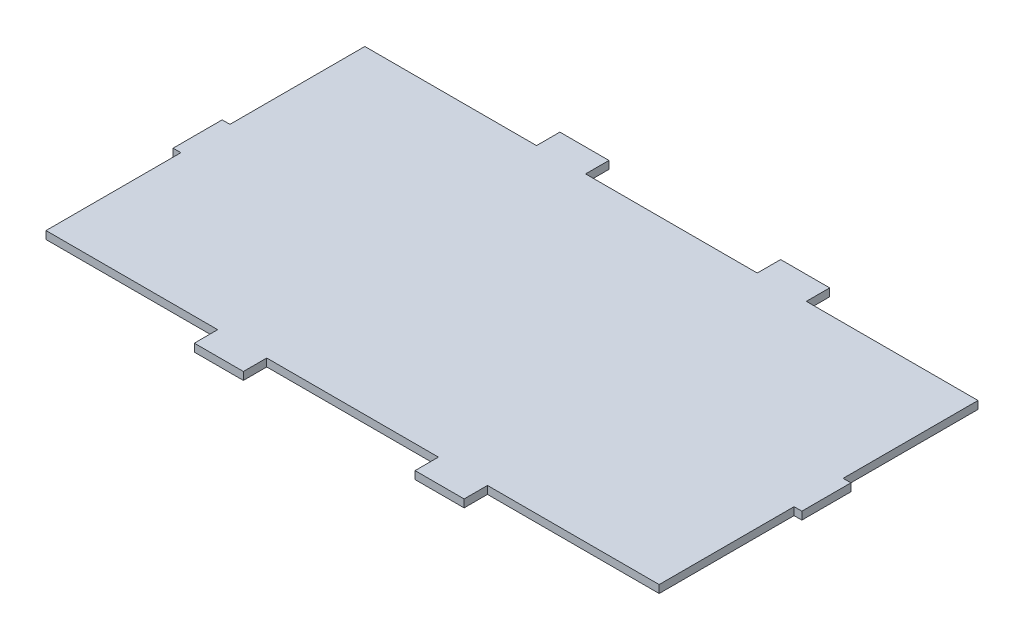
ISO-10303-21;
HEADER;
FILE_DESCRIPTION(('STEP AP214'),'2;1');
FILE_NAME('part.step','',(''),(''),'','','');
FILE_SCHEMA(('AUTOMOTIVE_DESIGN { 1 0 10303 214 1 1 1 1 }'));
ENDSEC;
DATA;
#1=APPLICATION_CONTEXT('core data for automotive mechanical design processes');
#2=APPLICATION_PROTOCOL_DEFINITION('international standard','automotive_design',2000,#1);
#3=PRODUCT_CONTEXT('',#1,'mechanical');
#4=PRODUCT('Part','Part','',(#3));
#5=PRODUCT_RELATED_PRODUCT_CATEGORY('part','',(#4));
#6=PRODUCT_DEFINITION_FORMATION('','',#4);
#7=PRODUCT_DEFINITION_CONTEXT('part definition',#1,'design');
#8=PRODUCT_DEFINITION('design','',#6,#7);
#9=PRODUCT_DEFINITION_SHAPE('','',#8);
#10=(LENGTH_UNIT() NAMED_UNIT(*) SI_UNIT(.MILLI.,.METRE.));
#11=(NAMED_UNIT(*) PLANE_ANGLE_UNIT() SI_UNIT($,.RADIAN.));
#12=(NAMED_UNIT(*) SI_UNIT($,.STERADIAN.) SOLID_ANGLE_UNIT());
#13=UNCERTAINTY_MEASURE_WITH_UNIT(LENGTH_MEASURE(1.E-05),#10,'distance_accuracy_value','');
#14=(GEOMETRIC_REPRESENTATION_CONTEXT(3) GLOBAL_UNCERTAINTY_ASSIGNED_CONTEXT((#13)) GLOBAL_UNIT_ASSIGNED_CONTEXT((#10,
#11,#12)) REPRESENTATION_CONTEXT('',''));
#15=CARTESIAN_POINT('',(0.,0.,0.));
#16=DIRECTION('',(0.,0.,1.));
#17=DIRECTION('',(1.,0.,0.));
#18=AXIS2_PLACEMENT_3D('',#15,#16,#17);
#19=CARTESIAN_POINT('',(0.,3.175,0.));
#20=DIRECTION('',(0.,0.,-1.));
#21=DIRECTION('',(-1.,0.,0.));
#22=AXIS2_PLACEMENT_3D('',#19,#20,#21);
#23=PLANE('',#22);
#24=DIRECTION('',(1.,0.,0.));
#25=VECTOR('',#24,1.);
#26=CARTESIAN_POINT('',(0.,3.175,0.));
#27=LINE('',#26,#25);
#28=CARTESIAN_POINT('',(90.,3.175,0.));
#29=VERTEX_POINT('',#28);
#30=CARTESIAN_POINT('',(160.,3.175,0.));
#31=VERTEX_POINT('',#30);
#32=EDGE_CURVE('E51',#29,#31,#27,.T.);
#33=ORIENTED_EDGE('',*,*,#32,.F.);
#34=DIRECTION('',(0.,1.,0.));
#35=VECTOR('',#34,1.);
#36=CARTESIAN_POINT('',(90.,0.,0.));
#37=LINE('',#36,#35);
#38=CARTESIAN_POINT('',(90.,0.,0.));
#39=VERTEX_POINT('',#38);
#40=EDGE_CURVE('E237',#39,#29,#37,.T.);
#41=ORIENTED_EDGE('',*,*,#40,.F.);
#42=DIRECTION('',(1.,0.,0.));
#43=VECTOR('',#42,1.);
#44=CARTESIAN_POINT('',(0.,0.,0.));
#45=LINE('',#44,#43);
#46=CARTESIAN_POINT('',(160.,0.,0.));
#47=VERTEX_POINT('',#46);
#48=EDGE_CURVE('E223',#39,#47,#45,.T.);
#49=ORIENTED_EDGE('',*,*,#48,.T.);
#50=DIRECTION('',(0.,1.,0.));
#51=VECTOR('',#50,1.);
#52=CARTESIAN_POINT('',(160.,0.,0.));
#53=LINE('',#52,#51);
#54=EDGE_CURVE('E284',#47,#31,#53,.T.);
#55=ORIENTED_EDGE('',*,*,#54,.T.);
#56=EDGE_LOOP('',(#33,#41,#49,#55));
#57=FACE_BOUND('',#56,.T.);
#58=ADVANCED_FACE('F36',(#57),#23,.F.);
#59=DIRECTION('',(0.,1.,0.));
#60=VECTOR('',#59,1.);
#61=CARTESIAN_POINT('',(180.,0.,0.));
#62=LINE('',#61,#60);
#63=CARTESIAN_POINT('',(180.,0.,0.));
#64=VERTEX_POINT('',#63);
#65=CARTESIAN_POINT('',(180.,3.175,0.));
#66=VERTEX_POINT('',#65);
#67=EDGE_CURVE('E271',#64,#66,#62,.T.);
#68=ORIENTED_EDGE('',*,*,#67,.F.);
#69=CARTESIAN_POINT('',(250.,0.,0.));
#70=VERTEX_POINT('',#69);
#71=EDGE_CURVE('E235',#64,#70,#45,.T.);
#72=ORIENTED_EDGE('',*,*,#71,.T.);
#73=DIRECTION('',(0.,-1.,0.));
#74=VECTOR('',#73,1.);
#75=CARTESIAN_POINT('',(250.,3.175,0.));
#76=LINE('',#75,#74);
#77=CARTESIAN_POINT('',(250.,3.175,0.));
#78=VERTEX_POINT('',#77);
#79=EDGE_CURVE('E44',#78,#70,#76,.T.);
#80=ORIENTED_EDGE('',*,*,#79,.F.);
#81=EDGE_CURVE('E395',#66,#78,#27,.T.);
#82=ORIENTED_EDGE('',*,*,#81,.F.);
#83=EDGE_LOOP('',(#68,#72,#80,#82));
#84=FACE_BOUND('',#83,.T.);
#85=ADVANCED_FACE('F452',(#84),#23,.F.);
#86=CARTESIAN_POINT('',(0.,3.175,-130.));
#87=DIRECTION('',(0.,0.,1.));
#88=DIRECTION('',(1.,0.,0.));
#89=AXIS2_PLACEMENT_3D('',#86,#87,#88);
#90=PLANE('',#89);
#91=DIRECTION('',(-1.,0.,0.));
#92=VECTOR('',#91,1.);
#93=CARTESIAN_POINT('',(0.,0.,-130.));
#94=LINE('',#93,#92);
#95=CARTESIAN_POINT('',(250.,0.,-130.));
#96=VERTEX_POINT('',#95);
#97=CARTESIAN_POINT('',(180.,0.,-130.));
#98=VERTEX_POINT('',#97);
#99=EDGE_CURVE('E417',#96,#98,#94,.T.);
#100=ORIENTED_EDGE('',*,*,#99,.T.);
#101=DIRECTION('',(0.,1.,0.));
#102=VECTOR('',#101,1.);
#103=CARTESIAN_POINT('',(180.,0.,-130.));
#104=LINE('',#103,#102);
#105=CARTESIAN_POINT('',(180.,3.175,-130.));
#106=VERTEX_POINT('',#105);
#107=EDGE_CURVE('E305',#98,#106,#104,.T.);
#108=ORIENTED_EDGE('',*,*,#107,.T.);
#109=DIRECTION('',(-1.,0.,0.));
#110=VECTOR('',#109,1.);
#111=CARTESIAN_POINT('',(0.,3.175,-130.));
#112=LINE('',#111,#110);
#113=CARTESIAN_POINT('',(250.,3.175,-130.));
#114=VERTEX_POINT('',#113);
#115=EDGE_CURVE('E404',#114,#106,#112,.T.);
#116=ORIENTED_EDGE('',*,*,#115,.F.);
#117=DIRECTION('',(0.,-1.,0.));
#118=VECTOR('',#117,1.);
#119=CARTESIAN_POINT('',(250.,3.175,-130.));
#120=LINE('',#119,#118);
#121=EDGE_CURVE('E422',#114,#96,#120,.T.);
#122=ORIENTED_EDGE('',*,*,#121,.T.);
#123=EDGE_LOOP('',(#100,#108,#116,#122));
#124=FACE_BOUND('',#123,.T.);
#125=ADVANCED_FACE('F454',(#124),#90,.F.);
#126=DIRECTION('',(0.,1.,0.));
#127=VECTOR('',#126,1.);
#128=CARTESIAN_POINT('',(70.,0.,-130.));
#129=LINE('',#128,#127);
#130=CARTESIAN_POINT('',(70.,0.,-130.));
#131=VERTEX_POINT('',#130);
#132=CARTESIAN_POINT('',(70.,3.175,-130.));
#133=VERTEX_POINT('',#132);
#134=EDGE_CURVE('E323',#131,#133,#129,.T.);
#135=ORIENTED_EDGE('',*,*,#134,.F.);
#136=CARTESIAN_POINT('',(0.,0.,-130.));
#137=VERTEX_POINT('',#136);
#138=EDGE_CURVE('E416',#131,#137,#94,.T.);
#139=ORIENTED_EDGE('',*,*,#138,.T.);
#140=DIRECTION('',(0.,-1.,0.));
#141=VECTOR('',#140,1.);
#142=CARTESIAN_POINT('',(0.,3.175,-130.));
#143=LINE('',#142,#141);
#144=CARTESIAN_POINT('',(0.,3.175,-130.));
#145=VERTEX_POINT('',#144);
#146=EDGE_CURVE('E407',#145,#137,#143,.T.);
#147=ORIENTED_EDGE('',*,*,#146,.F.);
#148=EDGE_CURVE('E403',#133,#145,#112,.T.);
#149=ORIENTED_EDGE('',*,*,#148,.F.);
#150=EDGE_LOOP('',(#135,#139,#147,#149));
#151=FACE_BOUND('',#150,.T.);
#152=ADVANCED_FACE('F460',(#151),#90,.F.);
#153=CARTESIAN_POINT('',(250.,3.175,0.));
#154=DIRECTION('',(-1.,0.,0.));
#155=DIRECTION('',(0.,0.,1.));
#156=AXIS2_PLACEMENT_3D('',#153,#154,#155);
#157=PLANE('',#156);
#158=DIRECTION('',(0.,1.,0.));
#159=VECTOR('',#158,1.);
#160=CARTESIAN_POINT('',(250.,0.,-75.));
#161=LINE('',#160,#159);
#162=CARTESIAN_POINT('',(250.,0.,-75.));
#163=VERTEX_POINT('',#162);
#164=CARTESIAN_POINT('',(250.,3.175,-75.));
#165=VERTEX_POINT('',#164);
#166=EDGE_CURVE('E357',#163,#165,#161,.T.);
#167=ORIENTED_EDGE('',*,*,#166,.F.);
#168=DIRECTION('',(0.,0.,-1.));
#169=VECTOR('',#168,1.);
#170=CARTESIAN_POINT('',(250.,0.,0.));
#171=LINE('',#170,#169);
#172=EDGE_CURVE('E412',#163,#96,#171,.T.);
#173=ORIENTED_EDGE('',*,*,#172,.T.);
#174=ORIENTED_EDGE('',*,*,#121,.F.);
#175=DIRECTION('',(0.,0.,-1.));
#176=VECTOR('',#175,1.);
#177=CARTESIAN_POINT('',(250.,3.175,0.));
#178=LINE('',#177,#176);
#179=EDGE_CURVE('E399',#165,#114,#178,.T.);
#180=ORIENTED_EDGE('',*,*,#179,.F.);
#181=EDGE_LOOP('',(#167,#173,#174,#180));
#182=FACE_BOUND('',#181,.T.);
#183=ADVANCED_FACE('F470',(#182),#157,.F.);
#184=CARTESIAN_POINT('',(0.,3.175,0.));
#185=DIRECTION('',(1.,0.,0.));
#186=DIRECTION('',(0.,0.,-1.));
#187=AXIS2_PLACEMENT_3D('',#184,#185,#186);
#188=PLANE('',#187);
#189=DIRECTION('',(0.,1.,0.));
#190=VECTOR('',#189,1.);
#191=CARTESIAN_POINT('',(0.,0.,-55.));
#192=LINE('',#191,#190);
#193=CARTESIAN_POINT('',(0.,0.,-55.));
#194=VERTEX_POINT('',#193);
#195=CARTESIAN_POINT('',(0.,3.175,-55.));
#196=VERTEX_POINT('',#195);
#197=EDGE_CURVE('E383',#194,#196,#192,.T.);
#198=ORIENTED_EDGE('',*,*,#197,.F.);
#199=DIRECTION('',(0.,0.,1.));
#200=VECTOR('',#199,1.);
#201=CARTESIAN_POINT('',(0.,0.,0.));
#202=LINE('',#201,#200);
#203=CARTESIAN_POINT('',(0.,0.,0.));
#204=VERTEX_POINT('',#203);
#205=EDGE_CURVE('E385',#194,#204,#202,.T.);
#206=ORIENTED_EDGE('',*,*,#205,.T.);
#207=DIRECTION('',(0.,-1.,0.));
#208=VECTOR('',#207,1.);
#209=CARTESIAN_POINT('',(0.,3.175,0.));
#210=LINE('',#209,#208);
#211=CARTESIAN_POINT('',(0.,3.175,0.));
#212=VERTEX_POINT('',#211);
#213=EDGE_CURVE('E11',#212,#204,#210,.T.);
#214=ORIENTED_EDGE('',*,*,#213,.F.);
#215=DIRECTION('',(0.,0.,1.));
#216=VECTOR('',#215,1.);
#217=CARTESIAN_POINT('',(0.,3.175,0.));
#218=LINE('',#217,#216);
#219=EDGE_CURVE('E396',#196,#212,#218,.T.);
#220=ORIENTED_EDGE('',*,*,#219,.F.);
#221=EDGE_LOOP('',(#198,#206,#214,#220));
#222=FACE_BOUND('',#221,.T.);
#223=ADVANCED_FACE('F471',(#222),#188,.F.);
#224=CARTESIAN_POINT('',(0.,0.,-75.));
#225=VERTEX_POINT('',#224);
#226=EDGE_CURVE('E409',#137,#225,#202,.T.);
#227=ORIENTED_EDGE('',*,*,#226,.T.);
#228=DIRECTION('',(0.,1.,0.));
#229=VECTOR('',#228,1.);
#230=CARTESIAN_POINT('',(0.,0.,-75.));
#231=LINE('',#230,#229);
#232=CARTESIAN_POINT('',(0.,3.175,-75.));
#233=VERTEX_POINT('',#232);
#234=EDGE_CURVE('E375',#225,#233,#231,.T.);
#235=ORIENTED_EDGE('',*,*,#234,.T.);
#236=EDGE_CURVE('E392',#145,#233,#218,.T.);
#237=ORIENTED_EDGE('',*,*,#236,.F.);
#238=ORIENTED_EDGE('',*,*,#146,.T.);
#239=EDGE_LOOP('',(#227,#235,#237,#238));
#240=FACE_BOUND('',#239,.T.);
#241=ADVANCED_FACE('F38',(#240),#188,.F.);
#242=CARTESIAN_POINT('',(70.,0.,0.));
#243=VERTEX_POINT('',#242);
#244=EDGE_CURVE('E234',#204,#243,#45,.T.);
#245=ORIENTED_EDGE('',*,*,#244,.T.);
#246=DIRECTION('',(0.,1.,0.));
#247=VECTOR('',#246,1.);
#248=CARTESIAN_POINT('',(70.,0.,0.));
#249=LINE('',#248,#247);
#250=CARTESIAN_POINT('',(70.,3.175,0.));
#251=VERTEX_POINT('',#250);
#252=EDGE_CURVE('E59',#243,#251,#249,.T.);
#253=ORIENTED_EDGE('',*,*,#252,.T.);
#254=EDGE_CURVE('E397',#212,#251,#27,.T.);
#255=ORIENTED_EDGE('',*,*,#254,.F.);
#256=ORIENTED_EDGE('',*,*,#213,.T.);
#257=EDGE_LOOP('',(#245,#253,#255,#256));
#258=FACE_BOUND('',#257,.T.);
#259=ADVANCED_FACE('F455',(#258),#23,.F.);
#260=CARTESIAN_POINT('',(250.,0.,-55.));
#261=VERTEX_POINT('',#260);
#262=EDGE_CURVE('E413',#70,#261,#171,.T.);
#263=ORIENTED_EDGE('',*,*,#262,.T.);
#264=DIRECTION('',(0.,1.,0.));
#265=VECTOR('',#264,1.);
#266=CARTESIAN_POINT('',(250.,0.,-55.));
#267=LINE('',#266,#265);
#268=CARTESIAN_POINT('',(250.,3.175,-55.));
#269=VERTEX_POINT('',#268);
#270=EDGE_CURVE('E349',#261,#269,#267,.T.);
#271=ORIENTED_EDGE('',*,*,#270,.T.);
#272=EDGE_CURVE('E400',#78,#269,#178,.T.);
#273=ORIENTED_EDGE('',*,*,#272,.F.);
#274=ORIENTED_EDGE('',*,*,#79,.T.);
#275=EDGE_LOOP('',(#263,#271,#273,#274));
#276=FACE_BOUND('',#275,.T.);
#277=ADVANCED_FACE('F429',(#276),#157,.F.);
#278=CARTESIAN_POINT('',(160.,3.175,-130.));
#279=VERTEX_POINT('',#278);
#280=CARTESIAN_POINT('',(90.,3.175,-130.));
#281=VERTEX_POINT('',#280);
#282=EDGE_CURVE('E408',#279,#281,#112,.T.);
#283=ORIENTED_EDGE('',*,*,#282,.F.);
#284=DIRECTION('',(0.,1.,0.));
#285=VECTOR('',#284,1.);
#286=CARTESIAN_POINT('',(160.,0.,-130.));
#287=LINE('',#286,#285);
#288=CARTESIAN_POINT('',(160.,0.,-130.));
#289=VERTEX_POINT('',#288);
#290=EDGE_CURVE('E308',#289,#279,#287,.T.);
#291=ORIENTED_EDGE('',*,*,#290,.F.);
#292=CARTESIAN_POINT('',(90.,0.,-130.));
#293=VERTEX_POINT('',#292);
#294=EDGE_CURVE('E419',#289,#293,#94,.T.);
#295=ORIENTED_EDGE('',*,*,#294,.T.);
#296=DIRECTION('',(0.,1.,0.));
#297=VECTOR('',#296,1.);
#298=CARTESIAN_POINT('',(90.,0.,-130.));
#299=LINE('',#298,#297);
#300=EDGE_CURVE('E336',#293,#281,#299,.T.);
#301=ORIENTED_EDGE('',*,*,#300,.T.);
#302=EDGE_LOOP('',(#283,#291,#295,#301));
#303=FACE_BOUND('',#302,.T.);
#304=ADVANCED_FACE('F463',(#303),#90,.F.);
#305=CARTESIAN_POINT('',(0.,3.175,0.));
#306=DIRECTION('',(0.,-1.,0.));
#307=DIRECTION('',(0.,0.,-1.));
#308=AXIS2_PLACEMENT_3D('',#305,#306,#307);
#309=PLANE('',#308);
#310=ORIENTED_EDGE('',*,*,#236,.T.);
#311=DIRECTION('',(-1.,0.,0.));
#312=VECTOR('',#311,1.);
#313=CARTESIAN_POINT('',(0.,3.175,-75.));
#314=LINE('',#313,#312);
#315=CARTESIAN_POINT('',(-3.175,3.175,-75.));
#316=VERTEX_POINT('',#315);
#317=EDGE_CURVE('E359',#233,#316,#314,.T.);
#318=ORIENTED_EDGE('',*,*,#317,.T.);
#319=DIRECTION('',(0.,0.,1.));
#320=VECTOR('',#319,1.);
#321=CARTESIAN_POINT('',(-3.175,3.175,-75.));
#322=LINE('',#321,#320);
#323=CARTESIAN_POINT('',(-3.175,3.175,-55.));
#324=VERTEX_POINT('',#323);
#325=EDGE_CURVE('E378',#316,#324,#322,.T.);
#326=ORIENTED_EDGE('',*,*,#325,.T.);
#327=DIRECTION('',(1.,0.,0.));
#328=VECTOR('',#327,1.);
#329=CARTESIAN_POINT('',(0.,3.175,-55.));
#330=LINE('',#329,#328);
#331=EDGE_CURVE('E370',#324,#196,#330,.T.);
#332=ORIENTED_EDGE('',*,*,#331,.T.);
#333=ORIENTED_EDGE('',*,*,#219,.T.);
#334=ORIENTED_EDGE('',*,*,#254,.T.);
#335=DIRECTION('',(0.,0.,1.));
#336=VECTOR('',#335,1.);
#337=CARTESIAN_POINT('',(70.,3.175,0.));
#338=LINE('',#337,#336);
#339=CARTESIAN_POINT('',(70.,3.175,9.525));
#340=VERTEX_POINT('',#339);
#341=EDGE_CURVE('E251',#251,#340,#338,.T.);
#342=ORIENTED_EDGE('',*,*,#341,.T.);
#343=DIRECTION('',(1.,0.,0.));
#344=VECTOR('',#343,1.);
#345=CARTESIAN_POINT('',(90.,3.175,9.525));
#346=LINE('',#345,#344);
#347=CARTESIAN_POINT('',(90.,3.175,9.525));
#348=VERTEX_POINT('',#347);
#349=EDGE_CURVE('E246',#340,#348,#346,.T.);
#350=ORIENTED_EDGE('',*,*,#349,.T.);
#351=DIRECTION('',(0.,0.,-1.));
#352=VECTOR('',#351,1.);
#353=CARTESIAN_POINT('',(90.,3.175,0.));
#354=LINE('',#353,#352);
#355=EDGE_CURVE('E255',#348,#29,#354,.T.);
#356=ORIENTED_EDGE('',*,*,#355,.T.);
#357=ORIENTED_EDGE('',*,*,#32,.T.);
#358=DIRECTION('',(0.,0.,1.));
#359=VECTOR('',#358,1.);
#360=CARTESIAN_POINT('',(160.,3.175,0.));
#361=LINE('',#360,#359);
#362=CARTESIAN_POINT('',(160.,3.175,9.525));
#363=VERTEX_POINT('',#362);
#364=EDGE_CURVE('E274',#31,#363,#361,.T.);
#365=ORIENTED_EDGE('',*,*,#364,.T.);
#366=DIRECTION('',(1.,0.,0.));
#367=VECTOR('',#366,1.);
#368=CARTESIAN_POINT('',(180.,3.175,9.525));
#369=LINE('',#368,#367);
#370=CARTESIAN_POINT('',(180.,3.175,9.525));
#371=VERTEX_POINT('',#370);
#372=EDGE_CURVE('E266',#363,#371,#369,.T.);
#373=ORIENTED_EDGE('',*,*,#372,.T.);
#374=DIRECTION('',(0.,0.,-1.));
#375=VECTOR('',#374,1.);
#376=CARTESIAN_POINT('',(180.,3.175,0.));
#377=LINE('',#376,#375);
#378=EDGE_CURVE('E260',#371,#66,#377,.T.);
#379=ORIENTED_EDGE('',*,*,#378,.T.);
#380=ORIENTED_EDGE('',*,*,#81,.T.);
#381=ORIENTED_EDGE('',*,*,#272,.T.);
#382=DIRECTION('',(1.,0.,0.));
#383=VECTOR('',#382,1.);
#384=CARTESIAN_POINT('',(250.,3.175,-55.));
#385=LINE('',#384,#383);
#386=CARTESIAN_POINT('',(253.175,3.175,-55.));
#387=VERTEX_POINT('',#386);
#388=EDGE_CURVE('E333',#269,#387,#385,.T.);
#389=ORIENTED_EDGE('',*,*,#388,.T.);
#390=DIRECTION('',(0.,0.,-1.));
#391=VECTOR('',#390,1.);
#392=CARTESIAN_POINT('',(253.175,3.175,-75.));
#393=LINE('',#392,#391);
#394=CARTESIAN_POINT('',(253.175,3.175,-75.));
#395=VERTEX_POINT('',#394);
#396=EDGE_CURVE('E352',#387,#395,#393,.T.);
#397=ORIENTED_EDGE('',*,*,#396,.T.);
#398=DIRECTION('',(-1.,0.,0.));
#399=VECTOR('',#398,1.);
#400=CARTESIAN_POINT('',(250.,3.175,-75.));
#401=LINE('',#400,#399);
#402=EDGE_CURVE('E344',#395,#165,#401,.T.);
#403=ORIENTED_EDGE('',*,*,#402,.T.);
#404=ORIENTED_EDGE('',*,*,#179,.T.);
#405=ORIENTED_EDGE('',*,*,#115,.T.);
#406=DIRECTION('',(0.,0.,-1.));
#407=VECTOR('',#406,1.);
#408=CARTESIAN_POINT('',(180.,3.175,-130.));
#409=LINE('',#408,#407);
#410=CARTESIAN_POINT('',(180.,3.175,-139.525));
#411=VERTEX_POINT('',#410);
#412=EDGE_CURVE('E281',#106,#411,#409,.T.);
#413=ORIENTED_EDGE('',*,*,#412,.T.);
#414=DIRECTION('',(-1.,0.,0.));
#415=VECTOR('',#414,1.);
#416=CARTESIAN_POINT('',(180.,3.175,-139.525));
#417=LINE('',#416,#415);
#418=CARTESIAN_POINT('',(160.,3.175,-139.525));
#419=VERTEX_POINT('',#418);
#420=EDGE_CURVE('E300',#411,#419,#417,.T.);
#421=ORIENTED_EDGE('',*,*,#420,.T.);
#422=DIRECTION('',(0.,0.,1.));
#423=VECTOR('',#422,1.);
#424=CARTESIAN_POINT('',(160.,3.175,-130.));
#425=LINE('',#424,#423);
#426=EDGE_CURVE('E291',#419,#279,#425,.T.);
#427=ORIENTED_EDGE('',*,*,#426,.T.);
#428=ORIENTED_EDGE('',*,*,#282,.T.);
#429=DIRECTION('',(0.,0.,-1.));
#430=VECTOR('',#429,1.);
#431=CARTESIAN_POINT('',(90.,3.175,-130.));
#432=LINE('',#431,#430);
#433=CARTESIAN_POINT('',(90.,3.175,-139.525));
#434=VERTEX_POINT('',#433);
#435=EDGE_CURVE('E326',#281,#434,#432,.T.);
#436=ORIENTED_EDGE('',*,*,#435,.T.);
#437=DIRECTION('',(-1.,0.,0.));
#438=VECTOR('',#437,1.);
#439=CARTESIAN_POINT('',(70.,3.175,-139.525));
#440=LINE('',#439,#438);
#441=CARTESIAN_POINT('',(70.,3.175,-139.525));
#442=VERTEX_POINT('',#441);
#443=EDGE_CURVE('E317',#434,#442,#440,.T.);
#444=ORIENTED_EDGE('',*,*,#443,.T.);
#445=DIRECTION('',(0.,0.,1.));
#446=VECTOR('',#445,1.);
#447=CARTESIAN_POINT('',(70.,3.175,-130.));
#448=LINE('',#447,#446);
#449=EDGE_CURVE('E307',#442,#133,#448,.T.);
#450=ORIENTED_EDGE('',*,*,#449,.T.);
#451=ORIENTED_EDGE('',*,*,#148,.T.);
#452=EDGE_LOOP('',(#310,#318,#326,#332,#333,#334,#342,#350,#356,#357,#365,#373,#379,#380,#381,
#389,#397,#403,#404,#405,#413,#421,#427,#428,#436,#444,#450,#451));
#453=FACE_BOUND('',#452,.T.);
#454=ADVANCED_FACE('F441',(#453),#309,.F.);
#455=CARTESIAN_POINT('',(0.,0.,0.));
#456=DIRECTION('',(0.,-1.,0.));
#457=DIRECTION('',(0.,0.,-1.));
#458=AXIS2_PLACEMENT_3D('',#455,#456,#457);
#459=PLANE('',#458);
#460=ORIENTED_EDGE('',*,*,#226,.F.);
#461=ORIENTED_EDGE('',*,*,#138,.F.);
#462=DIRECTION('',(0.,0.,1.));
#463=VECTOR('',#462,1.);
#464=CARTESIAN_POINT('',(70.,0.,-130.));
#465=LINE('',#464,#463);
#466=CARTESIAN_POINT('',(70.,0.,-139.525));
#467=VERTEX_POINT('',#466);
#468=EDGE_CURVE('E314',#467,#131,#465,.T.);
#469=ORIENTED_EDGE('',*,*,#468,.F.);
#470=DIRECTION('',(-1.,0.,0.));
#471=VECTOR('',#470,1.);
#472=CARTESIAN_POINT('',(70.,0.,-139.525));
#473=LINE('',#472,#471);
#474=CARTESIAN_POINT('',(90.,0.,-139.525));
#475=VERTEX_POINT('',#474);
#476=EDGE_CURVE('E320',#475,#467,#473,.T.);
#477=ORIENTED_EDGE('',*,*,#476,.F.);
#478=DIRECTION('',(0.,0.,-1.));
#479=VECTOR('',#478,1.);
#480=CARTESIAN_POINT('',(90.,0.,-130.));
#481=LINE('',#480,#479);
#482=EDGE_CURVE('E316',#293,#475,#481,.T.);
#483=ORIENTED_EDGE('',*,*,#482,.F.);
#484=ORIENTED_EDGE('',*,*,#294,.F.);
#485=DIRECTION('',(0.,0.,1.));
#486=VECTOR('',#485,1.);
#487=CARTESIAN_POINT('',(160.,0.,-130.));
#488=LINE('',#487,#486);
#489=CARTESIAN_POINT('',(160.,0.,-139.525));
#490=VERTEX_POINT('',#489);
#491=EDGE_CURVE('E294',#490,#289,#488,.T.);
#492=ORIENTED_EDGE('',*,*,#491,.F.);
#493=DIRECTION('',(-1.,0.,0.));
#494=VECTOR('',#493,1.);
#495=CARTESIAN_POINT('',(180.,0.,-139.525));
#496=LINE('',#495,#494);
#497=CARTESIAN_POINT('',(180.,0.,-139.525));
#498=VERTEX_POINT('',#497);
#499=EDGE_CURVE('E290',#498,#490,#496,.T.);
#500=ORIENTED_EDGE('',*,*,#499,.F.);
#501=DIRECTION('',(0.,0.,-1.));
#502=VECTOR('',#501,1.);
#503=CARTESIAN_POINT('',(180.,0.,-130.));
#504=LINE('',#503,#502);
#505=EDGE_CURVE('E287',#98,#498,#504,.T.);
#506=ORIENTED_EDGE('',*,*,#505,.F.);
#507=ORIENTED_EDGE('',*,*,#99,.F.);
#508=ORIENTED_EDGE('',*,*,#172,.F.);
#509=DIRECTION('',(-1.,0.,0.));
#510=VECTOR('',#509,1.);
#511=CARTESIAN_POINT('',(250.,0.,-75.));
#512=LINE('',#511,#510);
#513=CARTESIAN_POINT('',(253.175,0.,-75.));
#514=VERTEX_POINT('',#513);
#515=EDGE_CURVE('E347',#514,#163,#512,.T.);
#516=ORIENTED_EDGE('',*,*,#515,.F.);
#517=DIRECTION('',(0.,0.,-1.));
#518=VECTOR('',#517,1.);
#519=CARTESIAN_POINT('',(253.175,0.,-75.));
#520=LINE('',#519,#518);
#521=CARTESIAN_POINT('',(253.175,0.,-55.));
#522=VERTEX_POINT('',#521);
#523=EDGE_CURVE('E343',#522,#514,#520,.T.);
#524=ORIENTED_EDGE('',*,*,#523,.F.);
#525=DIRECTION('',(1.,0.,0.));
#526=VECTOR('',#525,1.);
#527=CARTESIAN_POINT('',(250.,0.,-55.));
#528=LINE('',#527,#526);
#529=EDGE_CURVE('E340',#261,#522,#528,.T.);
#530=ORIENTED_EDGE('',*,*,#529,.F.);
#531=ORIENTED_EDGE('',*,*,#262,.F.);
#532=ORIENTED_EDGE('',*,*,#71,.F.);
#533=DIRECTION('',(0.,0.,-1.));
#534=VECTOR('',#533,1.);
#535=CARTESIAN_POINT('',(180.,0.,0.));
#536=LINE('',#535,#534);
#537=CARTESIAN_POINT('',(180.,0.,9.525));
#538=VERTEX_POINT('',#537);
#539=EDGE_CURVE('E264',#538,#64,#536,.T.);
#540=ORIENTED_EDGE('',*,*,#539,.F.);
#541=DIRECTION('',(1.,0.,0.));
#542=VECTOR('',#541,1.);
#543=CARTESIAN_POINT('',(180.,0.,9.525));
#544=LINE('',#543,#542);
#545=CARTESIAN_POINT('',(160.,0.,9.525));
#546=VERTEX_POINT('',#545);
#547=EDGE_CURVE('E268',#546,#538,#544,.T.);
#548=ORIENTED_EDGE('',*,*,#547,.F.);
#549=DIRECTION('',(0.,0.,1.));
#550=VECTOR('',#549,1.);
#551=CARTESIAN_POINT('',(160.,0.,0.));
#552=LINE('',#551,#550);
#553=EDGE_CURVE('E232',#47,#546,#552,.T.);
#554=ORIENTED_EDGE('',*,*,#553,.F.);
#555=ORIENTED_EDGE('',*,*,#48,.F.);
#556=DIRECTION('',(0.,0.,-1.));
#557=VECTOR('',#556,1.);
#558=CARTESIAN_POINT('',(90.,0.,0.));
#559=LINE('',#558,#557);
#560=CARTESIAN_POINT('',(90.,0.,9.525));
#561=VERTEX_POINT('',#560);
#562=EDGE_CURVE('E228',#561,#39,#559,.T.);
#563=ORIENTED_EDGE('',*,*,#562,.F.);
#564=DIRECTION('',(1.,0.,0.));
#565=VECTOR('',#564,1.);
#566=CARTESIAN_POINT('',(90.,0.,9.525));
#567=LINE('',#566,#565);
#568=CARTESIAN_POINT('',(70.,0.,9.525));
#569=VERTEX_POINT('',#568);
#570=EDGE_CURVE('E241',#569,#561,#567,.T.);
#571=ORIENTED_EDGE('',*,*,#570,.F.);
#572=DIRECTION('',(0.,0.,1.));
#573=VECTOR('',#572,1.);
#574=CARTESIAN_POINT('',(70.,0.,0.));
#575=LINE('',#574,#573);
#576=EDGE_CURVE('E245',#243,#569,#575,.T.);
#577=ORIENTED_EDGE('',*,*,#576,.F.);
#578=ORIENTED_EDGE('',*,*,#244,.F.);
#579=ORIENTED_EDGE('',*,*,#205,.F.);
#580=DIRECTION('',(1.,0.,0.));
#581=VECTOR('',#580,1.);
#582=CARTESIAN_POINT('',(0.,0.,-55.));
#583=LINE('',#582,#581);
#584=CARTESIAN_POINT('',(-3.175,0.,-55.));
#585=VERTEX_POINT('',#584);
#586=EDGE_CURVE('E373',#585,#194,#583,.T.);
#587=ORIENTED_EDGE('',*,*,#586,.F.);
#588=DIRECTION('',(0.,0.,1.));
#589=VECTOR('',#588,1.);
#590=CARTESIAN_POINT('',(-3.175,0.,-75.));
#591=LINE('',#590,#589);
#592=CARTESIAN_POINT('',(-3.175,0.,-75.));
#593=VERTEX_POINT('',#592);
#594=EDGE_CURVE('E369',#593,#585,#591,.T.);
#595=ORIENTED_EDGE('',*,*,#594,.F.);
#596=DIRECTION('',(-1.,0.,0.));
#597=VECTOR('',#596,1.);
#598=CARTESIAN_POINT('',(0.,0.,-75.));
#599=LINE('',#598,#597);
#600=EDGE_CURVE('E366',#225,#593,#599,.T.);
#601=ORIENTED_EDGE('',*,*,#600,.F.);
#602=EDGE_LOOP('',(#460,#461,#469,#477,#483,#484,#492,#500,#506,#507,#508,#516,#524,#530,#531,
#532,#540,#548,#554,#555,#563,#571,#577,#578,#579,#587,#595,#601));
#603=FACE_BOUND('',#602,.T.);
#604=ADVANCED_FACE('F225',(#603),#459,.T.);
#605=CARTESIAN_POINT('',(0.,0.,-55.));
#606=DIRECTION('',(0.,0.,1.));
#607=DIRECTION('',(1.,0.,0.));
#608=AXIS2_PLACEMENT_3D('',#605,#606,#607);
#609=PLANE('',#608);
#610=ORIENTED_EDGE('',*,*,#331,.F.);
#611=DIRECTION('',(0.,1.,0.));
#612=VECTOR('',#611,1.);
#613=CARTESIAN_POINT('',(-3.175,0.,-55.));
#614=LINE('',#613,#612);
#615=EDGE_CURVE('E386',#585,#324,#614,.T.);
#616=ORIENTED_EDGE('',*,*,#615,.F.);
#617=ORIENTED_EDGE('',*,*,#586,.T.);
#618=ORIENTED_EDGE('',*,*,#197,.T.);
#619=EDGE_LOOP('',(#610,#616,#617,#618));
#620=FACE_BOUND('',#619,.T.);
#621=ADVANCED_FACE('F491',(#620),#609,.T.);
#622=CARTESIAN_POINT('',(-3.175,0.,-75.));
#623=DIRECTION('',(-1.,0.,0.));
#624=DIRECTION('',(0.,0.,1.));
#625=AXIS2_PLACEMENT_3D('',#622,#623,#624);
#626=PLANE('',#625);
#627=ORIENTED_EDGE('',*,*,#325,.F.);
#628=DIRECTION('',(0.,1.,0.));
#629=VECTOR('',#628,1.);
#630=CARTESIAN_POINT('',(-3.175,0.,-75.));
#631=LINE('',#630,#629);
#632=EDGE_CURVE('E388',#593,#316,#631,.T.);
#633=ORIENTED_EDGE('',*,*,#632,.F.);
#634=ORIENTED_EDGE('',*,*,#594,.T.);
#635=ORIENTED_EDGE('',*,*,#615,.T.);
#636=EDGE_LOOP('',(#627,#633,#634,#635));
#637=FACE_BOUND('',#636,.T.);
#638=ADVANCED_FACE('F494',(#637),#626,.T.);
#639=CARTESIAN_POINT('',(0.,0.,-75.));
#640=DIRECTION('',(0.,0.,-1.));
#641=DIRECTION('',(-1.,0.,0.));
#642=AXIS2_PLACEMENT_3D('',#639,#640,#641);
#643=PLANE('',#642);
#644=ORIENTED_EDGE('',*,*,#317,.F.);
#645=ORIENTED_EDGE('',*,*,#234,.F.);
#646=ORIENTED_EDGE('',*,*,#600,.T.);
#647=ORIENTED_EDGE('',*,*,#632,.T.);
#648=EDGE_LOOP('',(#644,#645,#646,#647));
#649=FACE_BOUND('',#648,.T.);
#650=ADVANCED_FACE('F496',(#649),#643,.T.);
#651=CARTESIAN_POINT('',(250.,0.,-75.));
#652=DIRECTION('',(0.,0.,-1.));
#653=DIRECTION('',(-1.,0.,0.));
#654=AXIS2_PLACEMENT_3D('',#651,#652,#653);
#655=PLANE('',#654);
#656=ORIENTED_EDGE('',*,*,#402,.F.);
#657=DIRECTION('',(0.,1.,0.));
#658=VECTOR('',#657,1.);
#659=CARTESIAN_POINT('',(253.175,0.,-75.));
#660=LINE('',#659,#658);
#661=EDGE_CURVE('E360',#514,#395,#660,.T.);
#662=ORIENTED_EDGE('',*,*,#661,.F.);
#663=ORIENTED_EDGE('',*,*,#515,.T.);
#664=ORIENTED_EDGE('',*,*,#166,.T.);
#665=EDGE_LOOP('',(#656,#662,#663,#664));
#666=FACE_BOUND('',#665,.T.);
#667=ADVANCED_FACE('F531',(#666),#655,.T.);
#668=CARTESIAN_POINT('',(253.175,0.,-75.));
#669=DIRECTION('',(1.,0.,0.));
#670=DIRECTION('',(0.,0.,-1.));
#671=AXIS2_PLACEMENT_3D('',#668,#669,#670);
#672=PLANE('',#671);
#673=ORIENTED_EDGE('',*,*,#396,.F.);
#674=DIRECTION('',(0.,1.,0.));
#675=VECTOR('',#674,1.);
#676=CARTESIAN_POINT('',(253.175,0.,-55.));
#677=LINE('',#676,#675);
#678=EDGE_CURVE('E362',#522,#387,#677,.T.);
#679=ORIENTED_EDGE('',*,*,#678,.F.);
#680=ORIENTED_EDGE('',*,*,#523,.T.);
#681=ORIENTED_EDGE('',*,*,#661,.T.);
#682=EDGE_LOOP('',(#673,#679,#680,#681));
#683=FACE_BOUND('',#682,.T.);
#684=ADVANCED_FACE('F527',(#683),#672,.T.);
#685=CARTESIAN_POINT('',(250.,0.,-55.));
#686=DIRECTION('',(0.,0.,1.));
#687=DIRECTION('',(1.,0.,0.));
#688=AXIS2_PLACEMENT_3D('',#685,#686,#687);
#689=PLANE('',#688);
#690=ORIENTED_EDGE('',*,*,#388,.F.);
#691=ORIENTED_EDGE('',*,*,#270,.F.);
#692=ORIENTED_EDGE('',*,*,#529,.T.);
#693=ORIENTED_EDGE('',*,*,#678,.T.);
#694=EDGE_LOOP('',(#690,#691,#692,#693));
#695=FACE_BOUND('',#694,.T.);
#696=ADVANCED_FACE('F438',(#695),#689,.T.);
#697=CARTESIAN_POINT('',(70.,0.,-130.));
#698=DIRECTION('',(-1.,0.,0.));
#699=DIRECTION('',(0.,0.,1.));
#700=AXIS2_PLACEMENT_3D('',#697,#698,#699);
#701=PLANE('',#700);
#702=ORIENTED_EDGE('',*,*,#449,.F.);
#703=DIRECTION('',(0.,1.,0.));
#704=VECTOR('',#703,1.);
#705=CARTESIAN_POINT('',(70.,0.,-139.525));
#706=LINE('',#705,#704);
#707=EDGE_CURVE('E331',#467,#442,#706,.T.);
#708=ORIENTED_EDGE('',*,*,#707,.F.);
#709=ORIENTED_EDGE('',*,*,#468,.T.);
#710=ORIENTED_EDGE('',*,*,#134,.T.);
#711=EDGE_LOOP('',(#702,#708,#709,#710));
#712=FACE_BOUND('',#711,.T.);
#713=ADVANCED_FACE('F519',(#712),#701,.T.);
#714=CARTESIAN_POINT('',(70.,0.,-139.525));
#715=DIRECTION('',(0.,0.,-1.));
#716=DIRECTION('',(-1.,0.,0.));
#717=AXIS2_PLACEMENT_3D('',#714,#715,#716);
#718=PLANE('',#717);
#719=ORIENTED_EDGE('',*,*,#443,.F.);
#720=DIRECTION('',(0.,1.,0.));
#721=VECTOR('',#720,1.);
#722=CARTESIAN_POINT('',(90.,0.,-139.525));
#723=LINE('',#722,#721);
#724=EDGE_CURVE('E334',#475,#434,#723,.T.);
#725=ORIENTED_EDGE('',*,*,#724,.F.);
#726=ORIENTED_EDGE('',*,*,#476,.T.);
#727=ORIENTED_EDGE('',*,*,#707,.T.);
#728=EDGE_LOOP('',(#719,#725,#726,#727));
#729=FACE_BOUND('',#728,.T.);
#730=ADVANCED_FACE('F515',(#729),#718,.T.);
#731=CARTESIAN_POINT('',(90.,0.,-130.));
#732=DIRECTION('',(1.,0.,0.));
#733=DIRECTION('',(0.,0.,-1.));
#734=AXIS2_PLACEMENT_3D('',#731,#732,#733);
#735=PLANE('',#734);
#736=ORIENTED_EDGE('',*,*,#435,.F.);
#737=ORIENTED_EDGE('',*,*,#300,.F.);
#738=ORIENTED_EDGE('',*,*,#482,.T.);
#739=ORIENTED_EDGE('',*,*,#724,.T.);
#740=EDGE_LOOP('',(#736,#737,#738,#739));
#741=FACE_BOUND('',#740,.T.);
#742=ADVANCED_FACE('F511',(#741),#735,.T.);
#743=CARTESIAN_POINT('',(180.,0.,-130.));
#744=DIRECTION('',(1.,0.,0.));
#745=DIRECTION('',(0.,0.,-1.));
#746=AXIS2_PLACEMENT_3D('',#743,#744,#745);
#747=PLANE('',#746);
#748=ORIENTED_EDGE('',*,*,#412,.F.);
#749=ORIENTED_EDGE('',*,*,#107,.F.);
#750=ORIENTED_EDGE('',*,*,#505,.T.);
#751=DIRECTION('',(0.,1.,0.));
#752=VECTOR('',#751,1.);
#753=CARTESIAN_POINT('',(180.,0.,-139.525));
#754=LINE('',#753,#752);
#755=EDGE_CURVE('E297',#498,#411,#754,.T.);
#756=ORIENTED_EDGE('',*,*,#755,.T.);
#757=EDGE_LOOP('',(#748,#749,#750,#756));
#758=FACE_BOUND('',#757,.T.);
#759=ADVANCED_FACE('F570',(#758),#747,.T.);
#760=CARTESIAN_POINT('',(160.,0.,-130.));
#761=DIRECTION('',(-1.,0.,0.));
#762=DIRECTION('',(0.,0.,1.));
#763=AXIS2_PLACEMENT_3D('',#760,#761,#762);
#764=PLANE('',#763);
#765=ORIENTED_EDGE('',*,*,#426,.F.);
#766=DIRECTION('',(0.,1.,0.));
#767=VECTOR('',#766,1.);
#768=CARTESIAN_POINT('',(160.,0.,-139.525));
#769=LINE('',#768,#767);
#770=EDGE_CURVE('E311',#490,#419,#769,.T.);
#771=ORIENTED_EDGE('',*,*,#770,.F.);
#772=ORIENTED_EDGE('',*,*,#491,.T.);
#773=ORIENTED_EDGE('',*,*,#290,.T.);
#774=EDGE_LOOP('',(#765,#771,#772,#773));
#775=FACE_BOUND('',#774,.T.);
#776=ADVANCED_FACE('F575',(#775),#764,.T.);
#777=CARTESIAN_POINT('',(180.,0.,-139.525));
#778=DIRECTION('',(0.,0.,-1.));
#779=DIRECTION('',(-1.,0.,0.));
#780=AXIS2_PLACEMENT_3D('',#777,#778,#779);
#781=PLANE('',#780);
#782=ORIENTED_EDGE('',*,*,#420,.F.);
#783=ORIENTED_EDGE('',*,*,#755,.F.);
#784=ORIENTED_EDGE('',*,*,#499,.T.);
#785=ORIENTED_EDGE('',*,*,#770,.T.);
#786=EDGE_LOOP('',(#782,#783,#784,#785));
#787=FACE_BOUND('',#786,.T.);
#788=ADVANCED_FACE('F573',(#787),#781,.T.);
#789=CARTESIAN_POINT('',(180.,0.,0.));
#790=DIRECTION('',(1.,0.,0.));
#791=DIRECTION('',(0.,0.,-1.));
#792=AXIS2_PLACEMENT_3D('',#789,#790,#791);
#793=PLANE('',#792);
#794=ORIENTED_EDGE('',*,*,#378,.F.);
#795=DIRECTION('',(0.,1.,0.));
#796=VECTOR('',#795,1.);
#797=CARTESIAN_POINT('',(180.,0.,9.525));
#798=LINE('',#797,#796);
#799=EDGE_CURVE('E279',#538,#371,#798,.T.);
#800=ORIENTED_EDGE('',*,*,#799,.F.);
#801=ORIENTED_EDGE('',*,*,#539,.T.);
#802=ORIENTED_EDGE('',*,*,#67,.T.);
#803=EDGE_LOOP('',(#794,#800,#801,#802));
#804=FACE_BOUND('',#803,.T.);
#805=ADVANCED_FACE('F451',(#804),#793,.T.);
#806=CARTESIAN_POINT('',(180.,0.,9.525));
#807=DIRECTION('',(0.,0.,1.));
#808=DIRECTION('',(1.,0.,0.));
#809=AXIS2_PLACEMENT_3D('',#806,#807,#808);
#810=PLANE('',#809);
#811=ORIENTED_EDGE('',*,*,#372,.F.);
#812=DIRECTION('',(0.,1.,0.));
#813=VECTOR('',#812,1.);
#814=CARTESIAN_POINT('',(160.,0.,9.525));
#815=LINE('',#814,#813);
#816=EDGE_CURVE('E282',#546,#363,#815,.T.);
#817=ORIENTED_EDGE('',*,*,#816,.F.);
#818=ORIENTED_EDGE('',*,*,#547,.T.);
#819=ORIENTED_EDGE('',*,*,#799,.T.);
#820=EDGE_LOOP('',(#811,#817,#818,#819));
#821=FACE_BOUND('',#820,.T.);
#822=ADVANCED_FACE('F449',(#821),#810,.T.);
#823=CARTESIAN_POINT('',(160.,0.,0.));
#824=DIRECTION('',(-1.,0.,0.));
#825=DIRECTION('',(0.,0.,1.));
#826=AXIS2_PLACEMENT_3D('',#823,#824,#825);
#827=PLANE('',#826);
#828=ORIENTED_EDGE('',*,*,#364,.F.);
#829=ORIENTED_EDGE('',*,*,#54,.F.);
#830=ORIENTED_EDGE('',*,*,#553,.T.);
#831=ORIENTED_EDGE('',*,*,#816,.T.);
#832=EDGE_LOOP('',(#828,#829,#830,#831));
#833=FACE_BOUND('',#832,.T.);
#834=ADVANCED_FACE('F447',(#833),#827,.T.);
#835=CARTESIAN_POINT('',(90.,0.,0.));
#836=DIRECTION('',(1.,0.,0.));
#837=DIRECTION('',(0.,0.,-1.));
#838=AXIS2_PLACEMENT_3D('',#835,#836,#837);
#839=PLANE('',#838);
#840=ORIENTED_EDGE('',*,*,#355,.F.);
#841=DIRECTION('',(0.,1.,0.));
#842=VECTOR('',#841,1.);
#843=CARTESIAN_POINT('',(90.,0.,9.525));
#844=LINE('',#843,#842);
#845=EDGE_CURVE('E244',#561,#348,#844,.T.);
#846=ORIENTED_EDGE('',*,*,#845,.F.);
#847=ORIENTED_EDGE('',*,*,#562,.T.);
#848=ORIENTED_EDGE('',*,*,#40,.T.);
#849=EDGE_LOOP('',(#840,#846,#847,#848));
#850=FACE_BOUND('',#849,.T.);
#851=ADVANCED_FACE('F243',(#850),#839,.T.);
#852=CARTESIAN_POINT('',(90.,0.,9.525));
#853=DIRECTION('',(0.,0.,1.));
#854=DIRECTION('',(1.,0.,0.));
#855=AXIS2_PLACEMENT_3D('',#852,#853,#854);
#856=PLANE('',#855);
#857=ORIENTED_EDGE('',*,*,#349,.F.);
#858=DIRECTION('',(0.,1.,0.));
#859=VECTOR('',#858,1.);
#860=CARTESIAN_POINT('',(70.,0.,9.525));
#861=LINE('',#860,#859);
#862=EDGE_CURVE('E261',#569,#340,#861,.T.);
#863=ORIENTED_EDGE('',*,*,#862,.F.);
#864=ORIENTED_EDGE('',*,*,#570,.T.);
#865=ORIENTED_EDGE('',*,*,#845,.T.);
#866=EDGE_LOOP('',(#857,#863,#864,#865));
#867=FACE_BOUND('',#866,.T.);
#868=ADVANCED_FACE('F482',(#867),#856,.T.);
#869=CARTESIAN_POINT('',(70.,0.,0.));
#870=DIRECTION('',(-1.,0.,0.));
#871=DIRECTION('',(0.,0.,1.));
#872=AXIS2_PLACEMENT_3D('',#869,#870,#871);
#873=PLANE('',#872);
#874=ORIENTED_EDGE('',*,*,#341,.F.);
#875=ORIENTED_EDGE('',*,*,#252,.F.);
#876=ORIENTED_EDGE('',*,*,#576,.T.);
#877=ORIENTED_EDGE('',*,*,#862,.T.);
#878=EDGE_LOOP('',(#874,#875,#876,#877));
#879=FACE_BOUND('',#878,.T.);
#880=ADVANCED_FACE('F479',(#879),#873,.T.);
#881=CLOSED_SHELL('',(#58,#85,#125,#152,#183,#223,#241,#259,#277,#304,#454,#604,#621,#638,#650,
#667,#684,#696,#713,#730,#742,#759,#776,#788,#805,#822,#834,#851,#868,#880));
#882=MANIFOLD_SOLID_BREP('B2',#881);
#883=ADVANCED_BREP_SHAPE_REPRESENTATION('',(#18,#882),#14);
#884=SHAPE_DEFINITION_REPRESENTATION(#9,#883);
ENDSEC;
END-ISO-10303-21;
